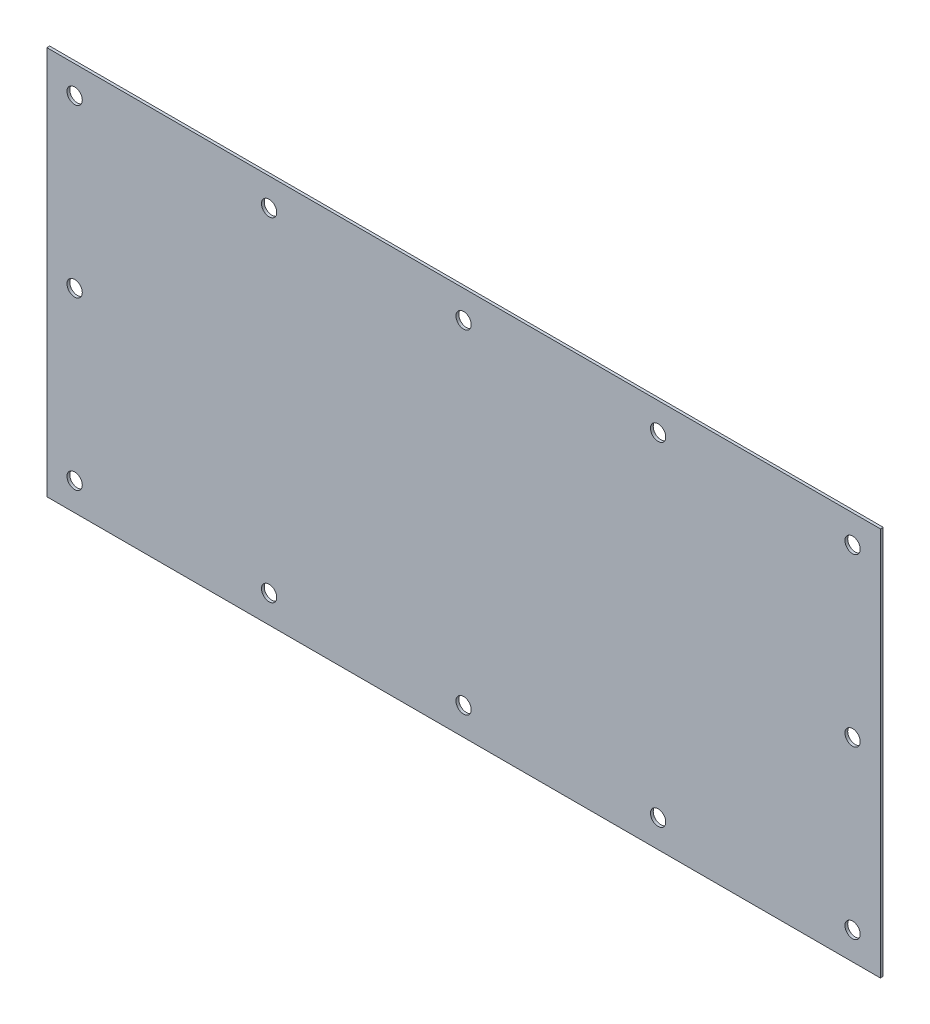
ISO-10303-21;
HEADER;
FILE_DESCRIPTION(('STEP AP214'),'2;1');
FILE_NAME('part.step','',(''),(''),'','','');
FILE_SCHEMA(('AUTOMOTIVE_DESIGN { 1 0 10303 214 1 1 1 1 }'));
ENDSEC;
DATA;
#1=APPLICATION_CONTEXT('core data for automotive mechanical design processes');
#2=APPLICATION_PROTOCOL_DEFINITION('international standard','automotive_design',2000,#1);
#3=PRODUCT_CONTEXT('',#1,'mechanical');
#4=PRODUCT('Part','Part','',(#3));
#5=PRODUCT_RELATED_PRODUCT_CATEGORY('part','',(#4));
#6=PRODUCT_DEFINITION_FORMATION('','',#4);
#7=PRODUCT_DEFINITION_CONTEXT('part definition',#1,'design');
#8=PRODUCT_DEFINITION('design','',#6,#7);
#9=PRODUCT_DEFINITION_SHAPE('','',#8);
#10=(LENGTH_UNIT() NAMED_UNIT(*) SI_UNIT(.MILLI.,.METRE.));
#11=(NAMED_UNIT(*) PLANE_ANGLE_UNIT() SI_UNIT($,.RADIAN.));
#12=(NAMED_UNIT(*) SI_UNIT($,.STERADIAN.) SOLID_ANGLE_UNIT());
#13=UNCERTAINTY_MEASURE_WITH_UNIT(LENGTH_MEASURE(1.E-05),#10,'distance_accuracy_value','');
#14=(GEOMETRIC_REPRESENTATION_CONTEXT(3) GLOBAL_UNCERTAINTY_ASSIGNED_CONTEXT((#13)) GLOBAL_UNIT_ASSIGNED_CONTEXT((#10,
#11,#12)) REPRESENTATION_CONTEXT('',''));
#15=CARTESIAN_POINT('',(0.,0.,0.));
#16=DIRECTION('',(0.,0.,1.));
#17=DIRECTION('',(1.,0.,0.));
#18=AXIS2_PLACEMENT_3D('',#15,#16,#17);
#19=CARTESIAN_POINT('',(-150.,-70.,1.));
#20=DIRECTION('',(-1.,0.,0.));
#21=DIRECTION('',(0.,0.,1.));
#22=AXIS2_PLACEMENT_3D('',#19,#20,#21);
#23=PLANE('',#22);
#24=DIRECTION('',(0.,1.,0.));
#25=VECTOR('',#24,1.);
#26=CARTESIAN_POINT('',(-150.,-70.,0.));
#27=LINE('',#26,#25);
#28=CARTESIAN_POINT('',(-150.,-70.,0.));
#29=VERTEX_POINT('',#28);
#30=CARTESIAN_POINT('',(-150.,70.,0.));
#31=VERTEX_POINT('',#30);
#32=EDGE_CURVE('E103',#29,#31,#27,.T.);
#33=ORIENTED_EDGE('',*,*,#32,.F.);
#34=DIRECTION('',(0.,0.,-1.));
#35=VECTOR('',#34,1.);
#36=CARTESIAN_POINT('',(-150.,-70.,1.));
#37=LINE('',#36,#35);
#38=CARTESIAN_POINT('',(-150.,-70.,1.));
#39=VERTEX_POINT('',#38);
#40=EDGE_CURVE('E11',#39,#29,#37,.T.);
#41=ORIENTED_EDGE('',*,*,#40,.F.);
#42=DIRECTION('',(0.,1.,0.));
#43=VECTOR('',#42,1.);
#44=CARTESIAN_POINT('',(-150.,-70.,1.));
#45=LINE('',#44,#43);
#46=CARTESIAN_POINT('',(-150.,70.,1.));
#47=VERTEX_POINT('',#46);
#48=EDGE_CURVE('E97',#39,#47,#45,.T.);
#49=ORIENTED_EDGE('',*,*,#48,.T.);
#50=DIRECTION('',(0.,0.,-1.));
#51=VECTOR('',#50,1.);
#52=CARTESIAN_POINT('',(-150.,70.,1.));
#53=LINE('',#52,#51);
#54=EDGE_CURVE('E40',#47,#31,#53,.T.);
#55=ORIENTED_EDGE('',*,*,#54,.T.);
#56=EDGE_LOOP('',(#33,#41,#49,#55));
#57=FACE_BOUND('',#56,.T.);
#58=ADVANCED_FACE('F37',(#57),#23,.T.);
#59=CARTESIAN_POINT('',(-150.,-70.,1.));
#60=DIRECTION('',(0.,1.,0.));
#61=DIRECTION('',(0.,0.,1.));
#62=AXIS2_PLACEMENT_3D('',#59,#60,#61);
#63=PLANE('',#62);
#64=DIRECTION('',(1.,0.,0.));
#65=VECTOR('',#64,1.);
#66=CARTESIAN_POINT('',(-150.,-70.,0.));
#67=LINE('',#66,#65);
#68=CARTESIAN_POINT('',(150.,-70.,0.));
#69=VERTEX_POINT('',#68);
#70=EDGE_CURVE('E70',#29,#69,#67,.T.);
#71=ORIENTED_EDGE('',*,*,#70,.T.);
#72=DIRECTION('',(0.,0.,-1.));
#73=VECTOR('',#72,1.);
#74=CARTESIAN_POINT('',(150.,-70.,1.));
#75=LINE('',#74,#73);
#76=CARTESIAN_POINT('',(150.,-70.,1.));
#77=VERTEX_POINT('',#76);
#78=EDGE_CURVE('E46',#77,#69,#75,.T.);
#79=ORIENTED_EDGE('',*,*,#78,.F.);
#80=DIRECTION('',(1.,0.,0.));
#81=VECTOR('',#80,1.);
#82=CARTESIAN_POINT('',(-150.,-70.,1.));
#83=LINE('',#82,#81);
#84=EDGE_CURVE('E87',#39,#77,#83,.T.);
#85=ORIENTED_EDGE('',*,*,#84,.F.);
#86=ORIENTED_EDGE('',*,*,#40,.T.);
#87=EDGE_LOOP('',(#71,#79,#85,#86));
#88=FACE_BOUND('',#87,.T.);
#89=ADVANCED_FACE('F114',(#88),#63,.F.);
#90=CARTESIAN_POINT('',(150.,-70.,1.));
#91=DIRECTION('',(-1.,0.,0.));
#92=DIRECTION('',(0.,0.,1.));
#93=AXIS2_PLACEMENT_3D('',#90,#91,#92);
#94=PLANE('',#93);
#95=DIRECTION('',(0.,1.,0.));
#96=VECTOR('',#95,1.);
#97=CARTESIAN_POINT('',(150.,-70.,0.));
#98=LINE('',#97,#96);
#99=CARTESIAN_POINT('',(150.,70.,0.));
#100=VERTEX_POINT('',#99);
#101=EDGE_CURVE('E94',#69,#100,#98,.T.);
#102=ORIENTED_EDGE('',*,*,#101,.T.);
#103=DIRECTION('',(0.,0.,-1.));
#104=VECTOR('',#103,1.);
#105=CARTESIAN_POINT('',(150.,70.,1.));
#106=LINE('',#105,#104);
#107=CARTESIAN_POINT('',(150.,70.,1.));
#108=VERTEX_POINT('',#107);
#109=EDGE_CURVE('E91',#108,#100,#106,.T.);
#110=ORIENTED_EDGE('',*,*,#109,.F.);
#111=DIRECTION('',(0.,1.,0.));
#112=VECTOR('',#111,1.);
#113=CARTESIAN_POINT('',(150.,-70.,1.));
#114=LINE('',#113,#112);
#115=EDGE_CURVE('E82',#77,#108,#114,.T.);
#116=ORIENTED_EDGE('',*,*,#115,.F.);
#117=ORIENTED_EDGE('',*,*,#78,.T.);
#118=EDGE_LOOP('',(#102,#110,#116,#117));
#119=FACE_BOUND('',#118,.T.);
#120=ADVANCED_FACE('F92',(#119),#94,.F.);
#121=CARTESIAN_POINT('',(-150.,70.,1.));
#122=DIRECTION('',(0.,1.,0.));
#123=DIRECTION('',(0.,0.,1.));
#124=AXIS2_PLACEMENT_3D('',#121,#122,#123);
#125=PLANE('',#124);
#126=DIRECTION('',(1.,0.,0.));
#127=VECTOR('',#126,1.);
#128=CARTESIAN_POINT('',(-150.,70.,0.));
#129=LINE('',#128,#127);
#130=EDGE_CURVE('E106',#31,#100,#129,.T.);
#131=ORIENTED_EDGE('',*,*,#130,.F.);
#132=ORIENTED_EDGE('',*,*,#54,.F.);
#133=DIRECTION('',(1.,0.,0.));
#134=VECTOR('',#133,1.);
#135=CARTESIAN_POINT('',(-150.,70.,1.));
#136=LINE('',#135,#134);
#137=EDGE_CURVE('E86',#47,#108,#136,.T.);
#138=ORIENTED_EDGE('',*,*,#137,.T.);
#139=ORIENTED_EDGE('',*,*,#109,.T.);
#140=EDGE_LOOP('',(#131,#132,#138,#139));
#141=FACE_BOUND('',#140,.T.);
#142=ADVANCED_FACE('F96',(#141),#125,.T.);
#143=CARTESIAN_POINT('',(0.,0.,1.));
#144=DIRECTION('',(0.,0.,-1.));
#145=DIRECTION('',(-1.,0.,0.));
#146=AXIS2_PLACEMENT_3D('',#143,#144,#145);
#147=PLANE('',#146);
#148=CARTESIAN_POINT('',(140.,60.0000000000001,1.));
#149=DIRECTION('',(0.,0.,-1.));
#150=DIRECTION('',(-1.,0.,0.));
#151=AXIS2_PLACEMENT_3D('',#148,#149,#150);
#152=CIRCLE('',#151,2.75);
#153=CARTESIAN_POINT('',(137.25,60.0000000000001,1.));
#154=VERTEX_POINT('',#153);
#155=EDGE_CURVE('E188',#154,#154,#152,.T.);
#156=ORIENTED_EDGE('',*,*,#155,.T.);
#157=EDGE_LOOP('',(#156));
#158=FACE_BOUND('',#157,.T.);
#159=CARTESIAN_POINT('',(70.,60.,1.));
#160=DIRECTION('',(0.,0.,-1.));
#161=DIRECTION('',(-1.,0.,0.));
#162=AXIS2_PLACEMENT_3D('',#159,#160,#161);
#163=CIRCLE('',#162,2.75);
#164=CARTESIAN_POINT('',(67.2499999999999,60.,1.));
#165=VERTEX_POINT('',#164);
#166=EDGE_CURVE('E198',#165,#165,#163,.T.);
#167=ORIENTED_EDGE('',*,*,#166,.T.);
#168=EDGE_LOOP('',(#167));
#169=FACE_BOUND('',#168,.T.);
#170=CARTESIAN_POINT('',(-70.,60.,1.));
#171=DIRECTION('',(0.,0.,-1.));
#172=DIRECTION('',(-1.,0.,0.));
#173=AXIS2_PLACEMENT_3D('',#170,#171,#172);
#174=CIRCLE('',#173,2.75);
#175=CARTESIAN_POINT('',(-72.75,60.,1.));
#176=VERTEX_POINT('',#175);
#177=EDGE_CURVE('E204',#176,#176,#174,.T.);
#178=ORIENTED_EDGE('',*,*,#177,.T.);
#179=EDGE_LOOP('',(#178));
#180=FACE_BOUND('',#179,.T.);
#181=CARTESIAN_POINT('',(0.,60.,1.));
#182=DIRECTION('',(0.,0.,-1.));
#183=DIRECTION('',(-1.,0.,0.));
#184=AXIS2_PLACEMENT_3D('',#181,#182,#183);
#185=CIRCLE('',#184,2.75);
#186=CARTESIAN_POINT('',(-2.75,60.,1.));
#187=VERTEX_POINT('',#186);
#188=EDGE_CURVE('E210',#187,#187,#185,.T.);
#189=ORIENTED_EDGE('',*,*,#188,.T.);
#190=EDGE_LOOP('',(#189));
#191=FACE_BOUND('',#190,.T.);
#192=CARTESIAN_POINT('',(-140.,60.,1.));
#193=DIRECTION('',(0.,0.,-1.));
#194=DIRECTION('',(-1.,0.,0.));
#195=AXIS2_PLACEMENT_3D('',#192,#193,#194);
#196=CIRCLE('',#195,2.75);
#197=CARTESIAN_POINT('',(-142.75,60.,1.));
#198=VERTEX_POINT('',#197);
#199=EDGE_CURVE('E216',#198,#198,#196,.T.);
#200=ORIENTED_EDGE('',*,*,#199,.T.);
#201=EDGE_LOOP('',(#200));
#202=FACE_BOUND('',#201,.T.);
#203=CARTESIAN_POINT('',(-140.,0.,1.));
#204=DIRECTION('',(0.,0.,-1.));
#205=DIRECTION('',(-1.,0.,0.));
#206=AXIS2_PLACEMENT_3D('',#203,#204,#205);
#207=CIRCLE('',#206,2.75);
#208=CARTESIAN_POINT('',(-142.75,0.,1.));
#209=VERTEX_POINT('',#208);
#210=EDGE_CURVE('E222',#209,#209,#207,.T.);
#211=ORIENTED_EDGE('',*,*,#210,.T.);
#212=EDGE_LOOP('',(#211));
#213=FACE_BOUND('',#212,.T.);
#214=CARTESIAN_POINT('',(-140.,-60.0000000000001,1.));
#215=DIRECTION('',(0.,0.,-1.));
#216=DIRECTION('',(-1.,0.,0.));
#217=AXIS2_PLACEMENT_3D('',#214,#215,#216);
#218=CIRCLE('',#217,2.75);
#219=CARTESIAN_POINT('',(-142.75,-60.0000000000001,1.));
#220=VERTEX_POINT('',#219);
#221=EDGE_CURVE('E228',#220,#220,#218,.T.);
#222=ORIENTED_EDGE('',*,*,#221,.T.);
#223=EDGE_LOOP('',(#222));
#224=FACE_BOUND('',#223,.T.);
#225=CARTESIAN_POINT('',(140.,0.,1.));
#226=DIRECTION('',(0.,0.,-1.));
#227=DIRECTION('',(-1.,0.,0.));
#228=AXIS2_PLACEMENT_3D('',#225,#226,#227);
#229=CIRCLE('',#228,2.75);
#230=CARTESIAN_POINT('',(137.25,0.,1.));
#231=VERTEX_POINT('',#230);
#232=EDGE_CURVE('E234',#231,#231,#229,.T.);
#233=ORIENTED_EDGE('',*,*,#232,.T.);
#234=EDGE_LOOP('',(#233));
#235=FACE_BOUND('',#234,.T.);
#236=CARTESIAN_POINT('',(140.,-60.0000000000001,1.));
#237=DIRECTION('',(0.,0.,-1.));
#238=DIRECTION('',(-1.,0.,0.));
#239=AXIS2_PLACEMENT_3D('',#236,#237,#238);
#240=CIRCLE('',#239,2.75);
#241=CARTESIAN_POINT('',(137.25,-60.0000000000001,1.));
#242=VERTEX_POINT('',#241);
#243=EDGE_CURVE('E240',#242,#242,#240,.T.);
#244=ORIENTED_EDGE('',*,*,#243,.T.);
#245=EDGE_LOOP('',(#244));
#246=FACE_BOUND('',#245,.T.);
#247=CARTESIAN_POINT('',(70.,-60.,1.));
#248=DIRECTION('',(0.,0.,-1.));
#249=DIRECTION('',(-1.,0.,0.));
#250=AXIS2_PLACEMENT_3D('',#247,#248,#249);
#251=CIRCLE('',#250,2.75);
#252=CARTESIAN_POINT('',(67.2499999999999,-60.,1.));
#253=VERTEX_POINT('',#252);
#254=EDGE_CURVE('E246',#253,#253,#251,.T.);
#255=ORIENTED_EDGE('',*,*,#254,.T.);
#256=EDGE_LOOP('',(#255));
#257=FACE_BOUND('',#256,.T.);
#258=CARTESIAN_POINT('',(-70.,-60.,1.));
#259=DIRECTION('',(0.,0.,-1.));
#260=DIRECTION('',(-1.,0.,0.));
#261=AXIS2_PLACEMENT_3D('',#258,#259,#260);
#262=CIRCLE('',#261,2.75);
#263=CARTESIAN_POINT('',(-72.75,-60.,1.));
#264=VERTEX_POINT('',#263);
#265=EDGE_CURVE('E252',#264,#264,#262,.T.);
#266=ORIENTED_EDGE('',*,*,#265,.T.);
#267=EDGE_LOOP('',(#266));
#268=FACE_BOUND('',#267,.T.);
#269=CARTESIAN_POINT('',(0.,-60.,1.));
#270=DIRECTION('',(0.,0.,-1.));
#271=DIRECTION('',(-1.,0.,0.));
#272=AXIS2_PLACEMENT_3D('',#269,#270,#271);
#273=CIRCLE('',#272,2.75);
#274=CARTESIAN_POINT('',(-2.74999999999997,-60.,1.));
#275=VERTEX_POINT('',#274);
#276=EDGE_CURVE('E107',#275,#275,#273,.T.);
#277=ORIENTED_EDGE('',*,*,#276,.T.);
#278=EDGE_LOOP('',(#277));
#279=FACE_BOUND('',#278,.T.);
#280=ORIENTED_EDGE('',*,*,#48,.F.);
#281=ORIENTED_EDGE('',*,*,#84,.T.);
#282=ORIENTED_EDGE('',*,*,#115,.T.);
#283=ORIENTED_EDGE('',*,*,#137,.F.);
#284=EDGE_LOOP('',(#280,#281,#282,#283));
#285=FACE_BOUND('',#284,.T.);
#286=ADVANCED_FACE('F85',(#158,#169,#180,#191,#202,#213,#224,#235,#246,#257,#268,#279,#285),
#147,.F.);
#287=CARTESIAN_POINT('',(0.,0.,0.));
#288=DIRECTION('',(0.,0.,-1.));
#289=DIRECTION('',(-1.,0.,0.));
#290=AXIS2_PLACEMENT_3D('',#287,#288,#289);
#291=PLANE('',#290);
#292=CARTESIAN_POINT('',(140.,60.0000000000001,0.));
#293=DIRECTION('',(0.,0.,-1.));
#294=DIRECTION('',(-1.,0.,0.));
#295=AXIS2_PLACEMENT_3D('',#292,#293,#294);
#296=CIRCLE('',#295,2.75);
#297=CARTESIAN_POINT('',(137.25,60.0000000000001,0.));
#298=VERTEX_POINT('',#297);
#299=EDGE_CURVE('E191',#298,#298,#296,.T.);
#300=ORIENTED_EDGE('',*,*,#299,.F.);
#301=EDGE_LOOP('',(#300));
#302=FACE_BOUND('',#301,.T.);
#303=CARTESIAN_POINT('',(70.,60.,0.));
#304=DIRECTION('',(0.,0.,-1.));
#305=DIRECTION('',(-1.,0.,0.));
#306=AXIS2_PLACEMENT_3D('',#303,#304,#305);
#307=CIRCLE('',#306,2.75);
#308=CARTESIAN_POINT('',(67.2499999999999,60.,0.));
#309=VERTEX_POINT('',#308);
#310=EDGE_CURVE('E193',#309,#309,#307,.T.);
#311=ORIENTED_EDGE('',*,*,#310,.F.);
#312=EDGE_LOOP('',(#311));
#313=FACE_BOUND('',#312,.T.);
#314=CARTESIAN_POINT('',(-70.,60.,0.));
#315=DIRECTION('',(0.,0.,-1.));
#316=DIRECTION('',(-1.,0.,0.));
#317=AXIS2_PLACEMENT_3D('',#314,#315,#316);
#318=CIRCLE('',#317,2.75);
#319=CARTESIAN_POINT('',(-72.75,60.,0.));
#320=VERTEX_POINT('',#319);
#321=EDGE_CURVE('E201',#320,#320,#318,.T.);
#322=ORIENTED_EDGE('',*,*,#321,.F.);
#323=EDGE_LOOP('',(#322));
#324=FACE_BOUND('',#323,.T.);
#325=CARTESIAN_POINT('',(0.,60.,0.));
#326=DIRECTION('',(0.,0.,-1.));
#327=DIRECTION('',(-1.,0.,0.));
#328=AXIS2_PLACEMENT_3D('',#325,#326,#327);
#329=CIRCLE('',#328,2.75);
#330=CARTESIAN_POINT('',(-2.75,60.,0.));
#331=VERTEX_POINT('',#330);
#332=EDGE_CURVE('E207',#331,#331,#329,.T.);
#333=ORIENTED_EDGE('',*,*,#332,.F.);
#334=EDGE_LOOP('',(#333));
#335=FACE_BOUND('',#334,.T.);
#336=CARTESIAN_POINT('',(-140.,60.,0.));
#337=DIRECTION('',(0.,0.,-1.));
#338=DIRECTION('',(-1.,0.,0.));
#339=AXIS2_PLACEMENT_3D('',#336,#337,#338);
#340=CIRCLE('',#339,2.75);
#341=CARTESIAN_POINT('',(-142.75,60.,0.));
#342=VERTEX_POINT('',#341);
#343=EDGE_CURVE('E213',#342,#342,#340,.T.);
#344=ORIENTED_EDGE('',*,*,#343,.F.);
#345=EDGE_LOOP('',(#344));
#346=FACE_BOUND('',#345,.T.);
#347=CARTESIAN_POINT('',(-140.,0.,0.));
#348=DIRECTION('',(0.,0.,-1.));
#349=DIRECTION('',(-1.,0.,0.));
#350=AXIS2_PLACEMENT_3D('',#347,#348,#349);
#351=CIRCLE('',#350,2.75);
#352=CARTESIAN_POINT('',(-142.75,0.,0.));
#353=VERTEX_POINT('',#352);
#354=EDGE_CURVE('E219',#353,#353,#351,.T.);
#355=ORIENTED_EDGE('',*,*,#354,.F.);
#356=EDGE_LOOP('',(#355));
#357=FACE_BOUND('',#356,.T.);
#358=CARTESIAN_POINT('',(-140.,-60.0000000000001,0.));
#359=DIRECTION('',(0.,0.,-1.));
#360=DIRECTION('',(-1.,0.,0.));
#361=AXIS2_PLACEMENT_3D('',#358,#359,#360);
#362=CIRCLE('',#361,2.75);
#363=CARTESIAN_POINT('',(-142.75,-60.0000000000001,0.));
#364=VERTEX_POINT('',#363);
#365=EDGE_CURVE('E225',#364,#364,#362,.T.);
#366=ORIENTED_EDGE('',*,*,#365,.F.);
#367=EDGE_LOOP('',(#366));
#368=FACE_BOUND('',#367,.T.);
#369=CARTESIAN_POINT('',(140.,0.,0.));
#370=DIRECTION('',(0.,0.,-1.));
#371=DIRECTION('',(-1.,0.,0.));
#372=AXIS2_PLACEMENT_3D('',#369,#370,#371);
#373=CIRCLE('',#372,2.75);
#374=CARTESIAN_POINT('',(137.25,0.,0.));
#375=VERTEX_POINT('',#374);
#376=EDGE_CURVE('E231',#375,#375,#373,.T.);
#377=ORIENTED_EDGE('',*,*,#376,.F.);
#378=EDGE_LOOP('',(#377));
#379=FACE_BOUND('',#378,.T.);
#380=CARTESIAN_POINT('',(140.,-60.0000000000001,0.));
#381=DIRECTION('',(0.,0.,-1.));
#382=DIRECTION('',(-1.,0.,0.));
#383=AXIS2_PLACEMENT_3D('',#380,#381,#382);
#384=CIRCLE('',#383,2.75);
#385=CARTESIAN_POINT('',(137.25,-60.0000000000001,0.));
#386=VERTEX_POINT('',#385);
#387=EDGE_CURVE('E237',#386,#386,#384,.T.);
#388=ORIENTED_EDGE('',*,*,#387,.F.);
#389=EDGE_LOOP('',(#388));
#390=FACE_BOUND('',#389,.T.);
#391=CARTESIAN_POINT('',(70.,-60.,0.));
#392=DIRECTION('',(0.,0.,-1.));
#393=DIRECTION('',(-1.,0.,0.));
#394=AXIS2_PLACEMENT_3D('',#391,#392,#393);
#395=CIRCLE('',#394,2.75);
#396=CARTESIAN_POINT('',(67.2499999999999,-60.,0.));
#397=VERTEX_POINT('',#396);
#398=EDGE_CURVE('E243',#397,#397,#395,.T.);
#399=ORIENTED_EDGE('',*,*,#398,.F.);
#400=EDGE_LOOP('',(#399));
#401=FACE_BOUND('',#400,.T.);
#402=CARTESIAN_POINT('',(-70.,-60.,0.));
#403=DIRECTION('',(0.,0.,-1.));
#404=DIRECTION('',(-1.,0.,0.));
#405=AXIS2_PLACEMENT_3D('',#402,#403,#404);
#406=CIRCLE('',#405,2.75);
#407=CARTESIAN_POINT('',(-72.75,-60.,0.));
#408=VERTEX_POINT('',#407);
#409=EDGE_CURVE('E249',#408,#408,#406,.T.);
#410=ORIENTED_EDGE('',*,*,#409,.F.);
#411=EDGE_LOOP('',(#410));
#412=FACE_BOUND('',#411,.T.);
#413=CARTESIAN_POINT('',(0.,-60.,0.));
#414=DIRECTION('',(0.,0.,-1.));
#415=DIRECTION('',(-1.,0.,0.));
#416=AXIS2_PLACEMENT_3D('',#413,#414,#415);
#417=CIRCLE('',#416,2.75);
#418=CARTESIAN_POINT('',(-2.74999999999997,-60.,0.));
#419=VERTEX_POINT('',#418);
#420=EDGE_CURVE('E255',#419,#419,#417,.T.);
#421=ORIENTED_EDGE('',*,*,#420,.F.);
#422=EDGE_LOOP('',(#421));
#423=FACE_BOUND('',#422,.T.);
#424=ORIENTED_EDGE('',*,*,#32,.T.);
#425=ORIENTED_EDGE('',*,*,#130,.T.);
#426=ORIENTED_EDGE('',*,*,#101,.F.);
#427=ORIENTED_EDGE('',*,*,#70,.F.);
#428=EDGE_LOOP('',(#424,#425,#426,#427));
#429=FACE_BOUND('',#428,.T.);
#430=ADVANCED_FACE('F112',(#302,#313,#324,#335,#346,#357,#368,#379,#390,#401,#412,#423,#429),
#291,.T.);
#431=CARTESIAN_POINT('',(0.,-60.,0.));
#432=DIRECTION('',(0.,0.,-1.));
#433=DIRECTION('',(-1.,0.,0.));
#434=AXIS2_PLACEMENT_3D('',#431,#432,#433);
#435=CYLINDRICAL_SURFACE('',#434,2.75);
#436=ORIENTED_EDGE('',*,*,#276,.F.);
#437=EDGE_LOOP('',(#436));
#438=FACE_BOUND('',#437,.T.);
#439=ORIENTED_EDGE('',*,*,#420,.T.);
#440=EDGE_LOOP('',(#439));
#441=FACE_BOUND('',#440,.T.);
#442=ADVANCED_FACE('F133',(#438,#441),#435,.F.);
#443=CARTESIAN_POINT('',(-70.,-60.,0.));
#444=DIRECTION('',(0.,0.,-1.));
#445=DIRECTION('',(-1.,0.,0.));
#446=AXIS2_PLACEMENT_3D('',#443,#444,#445);
#447=CYLINDRICAL_SURFACE('',#446,2.75);
#448=ORIENTED_EDGE('',*,*,#265,.F.);
#449=EDGE_LOOP('',(#448));
#450=FACE_BOUND('',#449,.T.);
#451=ORIENTED_EDGE('',*,*,#409,.T.);
#452=EDGE_LOOP('',(#451));
#453=FACE_BOUND('',#452,.T.);
#454=ADVANCED_FACE('F140',(#450,#453),#447,.F.);
#455=CARTESIAN_POINT('',(70.,-60.,0.));
#456=DIRECTION('',(0.,0.,-1.));
#457=DIRECTION('',(-1.,0.,0.));
#458=AXIS2_PLACEMENT_3D('',#455,#456,#457);
#459=CYLINDRICAL_SURFACE('',#458,2.75);
#460=ORIENTED_EDGE('',*,*,#254,.F.);
#461=EDGE_LOOP('',(#460));
#462=FACE_BOUND('',#461,.T.);
#463=ORIENTED_EDGE('',*,*,#398,.T.);
#464=EDGE_LOOP('',(#463));
#465=FACE_BOUND('',#464,.T.);
#466=ADVANCED_FACE('F144',(#462,#465),#459,.F.);
#467=CARTESIAN_POINT('',(140.,-60.0000000000001,0.));
#468=DIRECTION('',(0.,0.,-1.));
#469=DIRECTION('',(-1.,0.,0.));
#470=AXIS2_PLACEMENT_3D('',#467,#468,#469);
#471=CYLINDRICAL_SURFACE('',#470,2.75);
#472=ORIENTED_EDGE('',*,*,#243,.F.);
#473=EDGE_LOOP('',(#472));
#474=FACE_BOUND('',#473,.T.);
#475=ORIENTED_EDGE('',*,*,#387,.T.);
#476=EDGE_LOOP('',(#475));
#477=FACE_BOUND('',#476,.T.);
#478=ADVANCED_FACE('F148',(#474,#477),#471,.F.);
#479=CARTESIAN_POINT('',(140.,0.,0.));
#480=DIRECTION('',(0.,0.,-1.));
#481=DIRECTION('',(-1.,0.,0.));
#482=AXIS2_PLACEMENT_3D('',#479,#480,#481);
#483=CYLINDRICAL_SURFACE('',#482,2.75);
#484=ORIENTED_EDGE('',*,*,#232,.F.);
#485=EDGE_LOOP('',(#484));
#486=FACE_BOUND('',#485,.T.);
#487=ORIENTED_EDGE('',*,*,#376,.T.);
#488=EDGE_LOOP('',(#487));
#489=FACE_BOUND('',#488,.T.);
#490=ADVANCED_FACE('F152',(#486,#489),#483,.F.);
#491=CARTESIAN_POINT('',(-140.,-60.0000000000001,0.));
#492=DIRECTION('',(0.,0.,-1.));
#493=DIRECTION('',(-1.,0.,0.));
#494=AXIS2_PLACEMENT_3D('',#491,#492,#493);
#495=CYLINDRICAL_SURFACE('',#494,2.75);
#496=ORIENTED_EDGE('',*,*,#221,.F.);
#497=EDGE_LOOP('',(#496));
#498=FACE_BOUND('',#497,.T.);
#499=ORIENTED_EDGE('',*,*,#365,.T.);
#500=EDGE_LOOP('',(#499));
#501=FACE_BOUND('',#500,.T.);
#502=ADVANCED_FACE('F156',(#498,#501),#495,.F.);
#503=CARTESIAN_POINT('',(-140.,0.,0.));
#504=DIRECTION('',(0.,0.,-1.));
#505=DIRECTION('',(-1.,0.,0.));
#506=AXIS2_PLACEMENT_3D('',#503,#504,#505);
#507=CYLINDRICAL_SURFACE('',#506,2.75);
#508=ORIENTED_EDGE('',*,*,#210,.F.);
#509=EDGE_LOOP('',(#508));
#510=FACE_BOUND('',#509,.T.);
#511=ORIENTED_EDGE('',*,*,#354,.T.);
#512=EDGE_LOOP('',(#511));
#513=FACE_BOUND('',#512,.T.);
#514=ADVANCED_FACE('F160',(#510,#513),#507,.F.);
#515=CARTESIAN_POINT('',(-140.,60.,0.));
#516=DIRECTION('',(0.,0.,-1.));
#517=DIRECTION('',(-1.,0.,0.));
#518=AXIS2_PLACEMENT_3D('',#515,#516,#517);
#519=CYLINDRICAL_SURFACE('',#518,2.75);
#520=ORIENTED_EDGE('',*,*,#199,.F.);
#521=EDGE_LOOP('',(#520));
#522=FACE_BOUND('',#521,.T.);
#523=ORIENTED_EDGE('',*,*,#343,.T.);
#524=EDGE_LOOP('',(#523));
#525=FACE_BOUND('',#524,.T.);
#526=ADVANCED_FACE('F164',(#522,#525),#519,.F.);
#527=CARTESIAN_POINT('',(0.,60.,0.));
#528=DIRECTION('',(0.,0.,-1.));
#529=DIRECTION('',(-1.,0.,0.));
#530=AXIS2_PLACEMENT_3D('',#527,#528,#529);
#531=CYLINDRICAL_SURFACE('',#530,2.75);
#532=ORIENTED_EDGE('',*,*,#188,.F.);
#533=EDGE_LOOP('',(#532));
#534=FACE_BOUND('',#533,.T.);
#535=ORIENTED_EDGE('',*,*,#332,.T.);
#536=EDGE_LOOP('',(#535));
#537=FACE_BOUND('',#536,.T.);
#538=ADVANCED_FACE('F168',(#534,#537),#531,.F.);
#539=CARTESIAN_POINT('',(-70.,60.,0.));
#540=DIRECTION('',(0.,0.,-1.));
#541=DIRECTION('',(-1.,0.,0.));
#542=AXIS2_PLACEMENT_3D('',#539,#540,#541);
#543=CYLINDRICAL_SURFACE('',#542,2.75);
#544=ORIENTED_EDGE('',*,*,#177,.F.);
#545=EDGE_LOOP('',(#544));
#546=FACE_BOUND('',#545,.T.);
#547=ORIENTED_EDGE('',*,*,#321,.T.);
#548=EDGE_LOOP('',(#547));
#549=FACE_BOUND('',#548,.T.);
#550=ADVANCED_FACE('F172',(#546,#549),#543,.F.);
#551=CARTESIAN_POINT('',(70.,60.,0.));
#552=DIRECTION('',(0.,0.,-1.));
#553=DIRECTION('',(-1.,0.,0.));
#554=AXIS2_PLACEMENT_3D('',#551,#552,#553);
#555=CYLINDRICAL_SURFACE('',#554,2.75);
#556=ORIENTED_EDGE('',*,*,#166,.F.);
#557=EDGE_LOOP('',(#556));
#558=FACE_BOUND('',#557,.T.);
#559=ORIENTED_EDGE('',*,*,#310,.T.);
#560=EDGE_LOOP('',(#559));
#561=FACE_BOUND('',#560,.T.);
#562=ADVANCED_FACE('F176',(#558,#561),#555,.F.);
#563=CARTESIAN_POINT('',(140.,60.0000000000001,0.));
#564=DIRECTION('',(0.,0.,-1.));
#565=DIRECTION('',(-1.,0.,0.));
#566=AXIS2_PLACEMENT_3D('',#563,#564,#565);
#567=CYLINDRICAL_SURFACE('',#566,2.75);
#568=ORIENTED_EDGE('',*,*,#155,.F.);
#569=EDGE_LOOP('',(#568));
#570=FACE_BOUND('',#569,.T.);
#571=ORIENTED_EDGE('',*,*,#299,.T.);
#572=EDGE_LOOP('',(#571));
#573=FACE_BOUND('',#572,.T.);
#574=ADVANCED_FACE('F180',(#570,#573),#567,.F.);
#575=CLOSED_SHELL('',(#58,#89,#120,#142,#286,#430,#442,#454,#466,#478,#490,#502,#514,#526,#538,
#550,#562,#574));
#576=MANIFOLD_SOLID_BREP('B2',#575);
#577=ADVANCED_BREP_SHAPE_REPRESENTATION('',(#18,#576),#14);
#578=SHAPE_DEFINITION_REPRESENTATION(#9,#577);
ENDSEC;
END-ISO-10303-21;
